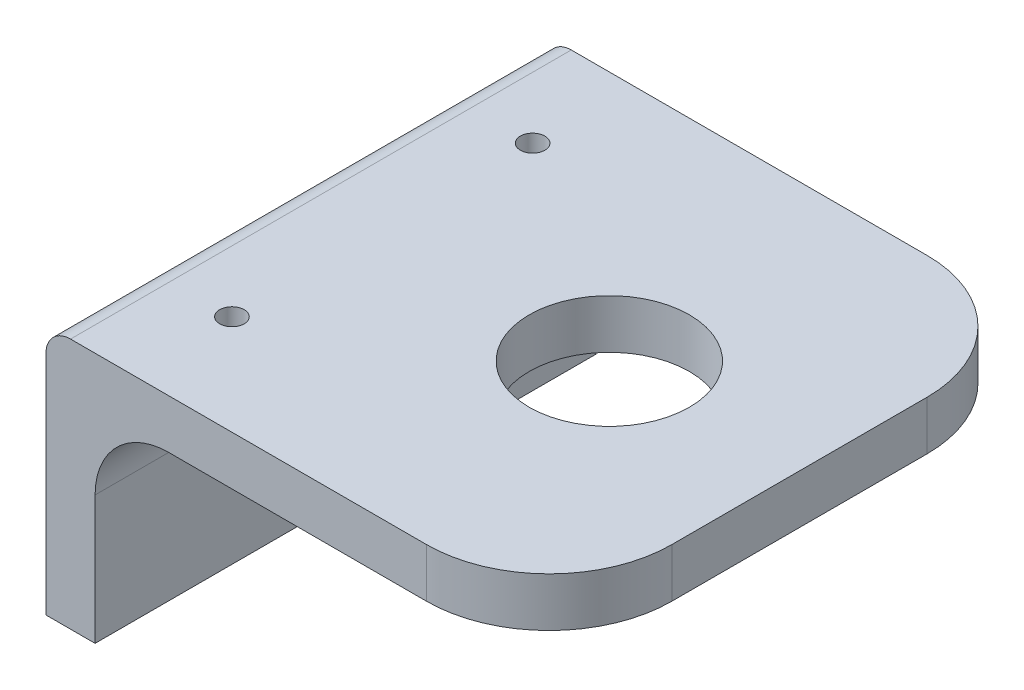
ISO-10303-21;
HEADER;
FILE_DESCRIPTION(('STEP AP214'),'2;1');
FILE_NAME('part.step','',(''),(''),'','','');
FILE_SCHEMA(('AUTOMOTIVE_DESIGN { 1 0 10303 214 1 1 1 1 }'));
ENDSEC;
DATA;
#1=APPLICATION_CONTEXT('core data for automotive mechanical design processes');
#2=APPLICATION_PROTOCOL_DEFINITION('international standard','automotive_design',2000,#1);
#3=PRODUCT_CONTEXT('',#1,'mechanical');
#4=PRODUCT('Part','Part','',(#3));
#5=PRODUCT_RELATED_PRODUCT_CATEGORY('part','',(#4));
#6=PRODUCT_DEFINITION_FORMATION('','',#4);
#7=PRODUCT_DEFINITION_CONTEXT('part definition',#1,'design');
#8=PRODUCT_DEFINITION('design','',#6,#7);
#9=PRODUCT_DEFINITION_SHAPE('','',#8);
#10=(LENGTH_UNIT() NAMED_UNIT(*) SI_UNIT(.MILLI.,.METRE.));
#11=(NAMED_UNIT(*) PLANE_ANGLE_UNIT() SI_UNIT($,.RADIAN.));
#12=(NAMED_UNIT(*) SI_UNIT($,.STERADIAN.) SOLID_ANGLE_UNIT());
#13=UNCERTAINTY_MEASURE_WITH_UNIT(LENGTH_MEASURE(1.E-05),#10,'distance_accuracy_value','');
#14=(GEOMETRIC_REPRESENTATION_CONTEXT(3) GLOBAL_UNCERTAINTY_ASSIGNED_CONTEXT((#13)) GLOBAL_UNIT_ASSIGNED_CONTEXT((#10,
#11,#12)) REPRESENTATION_CONTEXT('',''));
#15=CARTESIAN_POINT('',(0.,0.,0.));
#16=DIRECTION('',(0.,0.,1.));
#17=DIRECTION('',(1.,0.,0.));
#18=AXIS2_PLACEMENT_3D('',#15,#16,#17);
#19=CARTESIAN_POINT('',(0.,40.95,0.));
#20=DIRECTION('',(0.,1.,0.));
#21=DIRECTION('',(0.,0.,1.));
#22=AXIS2_PLACEMENT_3D('',#19,#20,#21);
#23=PLANE('',#22);
#24=DIRECTION('',(-1.,0.,0.));
#25=VECTOR('',#24,1.);
#26=CARTESIAN_POINT('',(41.,40.95,-40.8));
#27=LINE('',#26,#25);
#28=CARTESIAN_POINT('',(-33.,40.95,-40.8));
#29=VERTEX_POINT('',#28);
#30=CARTESIAN_POINT('',(-41.,40.95,-40.8));
#31=VERTEX_POINT('',#30);
#32=EDGE_CURVE('E197',#29,#31,#27,.T.);
#33=ORIENTED_EDGE('',*,*,#32,.F.);
#34=DIRECTION('',(0.,0.,-1.));
#35=VECTOR('',#34,1.);
#36=CARTESIAN_POINT('',(-33.,40.95,40.8));
#37=LINE('',#36,#35);
#38=CARTESIAN_POINT('',(-33.,40.95,40.8));
#39=VERTEX_POINT('',#38);
#40=EDGE_CURVE('E195',#39,#29,#37,.T.);
#41=ORIENTED_EDGE('',*,*,#40,.F.);
#42=DIRECTION('',(1.,0.,0.));
#43=VECTOR('',#42,1.);
#44=CARTESIAN_POINT('',(41.,40.95,40.8));
#45=LINE('',#44,#43);
#46=CARTESIAN_POINT('',(-41.,40.95,40.8));
#47=VERTEX_POINT('',#46);
#48=EDGE_CURVE('E46',#47,#39,#45,.T.);
#49=ORIENTED_EDGE('',*,*,#48,.F.);
#50=DIRECTION('',(0.,0.,1.));
#51=VECTOR('',#50,1.);
#52=CARTESIAN_POINT('',(-41.,40.95,40.8));
#53=LINE('',#52,#51);
#54=EDGE_CURVE('E11',#31,#47,#53,.T.);
#55=ORIENTED_EDGE('',*,*,#54,.F.);
#56=EDGE_LOOP('',(#33,#41,#49,#55));
#57=FACE_BOUND('',#56,.T.);
#58=ADVANCED_FACE('F39',(#57),#23,.F.);
#59=CARTESIAN_POINT('',(0.,73.9,0.));
#60=DIRECTION('',(0.,1.,0.));
#61=DIRECTION('',(0.,0.,1.));
#62=AXIS2_PLACEMENT_3D('',#59,#60,#61);
#63=PLANE('',#62);
#64=CARTESIAN_POINT('',(-27.,73.9,24.5));
#65=DIRECTION('',(0.,1.,0.));
#66=DIRECTION('',(0.,0.,1.));
#67=AXIS2_PLACEMENT_3D('',#64,#65,#66);
#68=CIRCLE('',#67,2.);
#69=CARTESIAN_POINT('',(-27.,73.9,26.5));
#70=VERTEX_POINT('',#69);
#71=EDGE_CURVE('E235',#70,#70,#68,.T.);
#72=ORIENTED_EDGE('',*,*,#71,.T.);
#73=EDGE_LOOP('',(#72));
#74=FACE_BOUND('',#73,.T.);
#75=ADVANCED_FACE('F305',(#74),#63,.T.);
#76=CARTESIAN_POINT('',(0.,73.9,0.));
#77=DIRECTION('',(0.,1.,0.));
#78=DIRECTION('',(0.,0.,1.));
#79=AXIS2_PLACEMENT_3D('',#76,#77,#78);
#80=PLANE('',#79);
#81=CARTESIAN_POINT('',(-27.,73.9,-24.5));
#82=DIRECTION('',(0.,1.,0.));
#83=DIRECTION('',(0.,0.,1.));
#84=AXIS2_PLACEMENT_3D('',#81,#82,#83);
#85=CIRCLE('',#84,2.);
#86=CARTESIAN_POINT('',(-27.,73.9,-22.5));
#87=VERTEX_POINT('',#86);
#88=EDGE_CURVE('E230',#87,#87,#85,.T.);
#89=ORIENTED_EDGE('',*,*,#88,.T.);
#90=EDGE_LOOP('',(#89));
#91=FACE_BOUND('',#90,.T.);
#92=ADVANCED_FACE('F309',(#91),#80,.T.);
#93=CARTESIAN_POINT('',(41.,81.9,40.8));
#94=DIRECTION('',(-1.,0.,0.));
#95=DIRECTION('',(0.,0.,1.));
#96=AXIS2_PLACEMENT_3D('',#93,#94,#95);
#97=PLANE('',#96);
#98=DIRECTION('',(0.,0.,-1.));
#99=VECTOR('',#98,1.);
#100=CARTESIAN_POINT('',(41.,81.9,40.8));
#101=LINE('',#100,#99);
#102=CARTESIAN_POINT('',(41.,81.9,20.8));
#103=VERTEX_POINT('',#102);
#104=CARTESIAN_POINT('',(41.,81.9,-20.8));
#105=VERTEX_POINT('',#104);
#106=EDGE_CURVE('E223',#103,#105,#101,.T.);
#107=ORIENTED_EDGE('',*,*,#106,.F.);
#108=DIRECTION('',(0.,-1.,0.));
#109=VECTOR('',#108,1.);
#110=CARTESIAN_POINT('',(41.,81.9,20.8));
#111=LINE('',#110,#109);
#112=CARTESIAN_POINT('',(41.,73.9,20.8));
#113=VERTEX_POINT('',#112);
#114=EDGE_CURVE('E172',#103,#113,#111,.T.);
#115=ORIENTED_EDGE('',*,*,#114,.T.);
#116=DIRECTION('',(0.,0.,-1.));
#117=VECTOR('',#116,1.);
#118=CARTESIAN_POINT('',(41.,73.9,40.8));
#119=LINE('',#118,#117);
#120=CARTESIAN_POINT('',(41.,73.9,-20.8));
#121=VERTEX_POINT('',#120);
#122=EDGE_CURVE('E214',#113,#121,#119,.T.);
#123=ORIENTED_EDGE('',*,*,#122,.T.);
#124=DIRECTION('',(0.,-1.,0.));
#125=VECTOR('',#124,1.);
#126=CARTESIAN_POINT('',(41.,81.9,-20.8));
#127=LINE('',#126,#125);
#128=EDGE_CURVE('E170',#121,#105,#127,.F.);
#129=ORIENTED_EDGE('',*,*,#128,.T.);
#130=EDGE_LOOP('',(#107,#115,#123,#129));
#131=FACE_BOUND('',#130,.T.);
#132=ADVANCED_FACE('F280',(#131),#97,.F.);
#133=CARTESIAN_POINT('',(10.,81.901,0.));
#134=DIRECTION('',(0.,-1.,0.));
#135=DIRECTION('',(0.,0.,-1.));
#136=AXIS2_PLACEMENT_3D('',#133,#134,#135);
#137=CYLINDRICAL_SURFACE('',#136,13.05);
#138=CARTESIAN_POINT('',(10.,81.9,0.));
#139=DIRECTION('',(0.,1.,0.));
#140=DIRECTION('',(0.,0.,1.));
#141=AXIS2_PLACEMENT_3D('',#138,#139,#140);
#142=CIRCLE('',#141,13.05);
#143=CARTESIAN_POINT('',(10.,81.9,13.05));
#144=VERTEX_POINT('',#143);
#145=EDGE_CURVE('E227',#144,#144,#142,.F.);
#146=ORIENTED_EDGE('',*,*,#145,.F.);
#147=EDGE_LOOP('',(#146));
#148=FACE_BOUND('',#147,.T.);
#149=CARTESIAN_POINT('',(10.,73.9,0.));
#150=DIRECTION('',(0.,-1.,0.));
#151=DIRECTION('',(0.,0.,-1.));
#152=AXIS2_PLACEMENT_3D('',#149,#150,#151);
#153=CIRCLE('',#152,13.05);
#154=CARTESIAN_POINT('',(10.,73.9,-13.05));
#155=VERTEX_POINT('',#154);
#156=EDGE_CURVE('E220',#155,#155,#153,.T.);
#157=ORIENTED_EDGE('',*,*,#156,.T.);
#158=EDGE_LOOP('',(#157));
#159=FACE_BOUND('',#158,.T.);
#160=ADVANCED_FACE('F332',(#148,#159),#137,.F.);
#161=CARTESIAN_POINT('',(-27.,73.9,24.5));
#162=DIRECTION('',(0.,1.,0.));
#163=DIRECTION('',(0.,0.,1.));
#164=AXIS2_PLACEMENT_3D('',#161,#162,#163);
#165=CYLINDRICAL_SURFACE('',#164,2.);
#166=ORIENTED_EDGE('',*,*,#71,.F.);
#167=EDGE_LOOP('',(#166));
#168=FACE_BOUND('',#167,.T.);
#169=CARTESIAN_POINT('',(-27.,81.9,24.5));
#170=DIRECTION('',(0.,1.,0.));
#171=DIRECTION('',(0.,0.,1.));
#172=AXIS2_PLACEMENT_3D('',#169,#170,#171);
#173=CIRCLE('',#172,2.);
#174=CARTESIAN_POINT('',(-27.,81.9,26.5));
#175=VERTEX_POINT('',#174);
#176=EDGE_CURVE('E141',#175,#175,#173,.T.);
#177=ORIENTED_EDGE('',*,*,#176,.T.);
#178=EDGE_LOOP('',(#177));
#179=FACE_BOUND('',#178,.T.);
#180=ADVANCED_FACE('F335',(#168,#179),#165,.F.);
#181=CARTESIAN_POINT('',(-27.,73.9,-24.5));
#182=DIRECTION('',(0.,1.,0.));
#183=DIRECTION('',(0.,0.,1.));
#184=AXIS2_PLACEMENT_3D('',#181,#182,#183);
#185=CYLINDRICAL_SURFACE('',#184,2.);
#186=ORIENTED_EDGE('',*,*,#88,.F.);
#187=EDGE_LOOP('',(#186));
#188=FACE_BOUND('',#187,.T.);
#189=CARTESIAN_POINT('',(-27.,81.9,-24.5));
#190=DIRECTION('',(0.,1.,0.));
#191=DIRECTION('',(0.,0.,1.));
#192=AXIS2_PLACEMENT_3D('',#189,#190,#191);
#193=CIRCLE('',#192,2.);
#194=CARTESIAN_POINT('',(-27.,81.9,-22.5));
#195=VERTEX_POINT('',#194);
#196=EDGE_CURVE('E238',#195,#195,#193,.T.);
#197=ORIENTED_EDGE('',*,*,#196,.T.);
#198=EDGE_LOOP('',(#197));
#199=FACE_BOUND('',#198,.T.);
#200=ADVANCED_FACE('F338',(#188,#199),#185,.F.);
#201=CARTESIAN_POINT('',(-33.,60.95,-25.));
#202=DIRECTION('',(-1.,0.,0.));
#203=DIRECTION('',(0.,0.,1.));
#204=AXIS2_PLACEMENT_3D('',#201,#202,#203);
#205=PLANE('',#204);
#206=CARTESIAN_POINT('',(-33.,60.95,-25.));
#207=DIRECTION('',(-1.,0.,0.));
#208=DIRECTION('',(0.,0.,1.));
#209=AXIS2_PLACEMENT_3D('',#206,#207,#208);
#210=CIRCLE('',#209,2.);
#211=CARTESIAN_POINT('',(-33.,61.9,-23.2400284093202));
#212=VERTEX_POINT('',#211);
#213=CARTESIAN_POINT('',(-33.,61.9,-26.7599715906798));
#214=VERTEX_POINT('',#213);
#215=EDGE_CURVE('E127',#212,#214,#210,.T.);
#216=ORIENTED_EDGE('',*,*,#215,.T.);
#217=DIRECTION('',(0.,0.,-1.));
#218=VECTOR('',#217,1.);
#219=CARTESIAN_POINT('',(-33.,61.9,40.8));
#220=LINE('',#219,#218);
#221=EDGE_CURVE('E124',#214,#212,#220,.F.);
#222=ORIENTED_EDGE('',*,*,#221,.T.);
#223=EDGE_LOOP('',(#216,#222));
#224=FACE_BOUND('',#223,.T.);
#225=ADVANCED_FACE('F126',(#224),#205,.T.);
#226=CARTESIAN_POINT('',(-33.,60.95,25.));
#227=DIRECTION('',(1.,0.,0.));
#228=DIRECTION('',(0.,0.,-1.));
#229=AXIS2_PLACEMENT_3D('',#226,#227,#228);
#230=PLANE('',#229);
#231=CARTESIAN_POINT('',(-33.,60.95,25.));
#232=DIRECTION('',(-1.,0.,0.));
#233=DIRECTION('',(0.,0.,-1.));
#234=AXIS2_PLACEMENT_3D('',#231,#232,#233);
#235=CIRCLE('',#234,2.);
#236=CARTESIAN_POINT('',(-33.,61.9,26.7599715906798));
#237=VERTEX_POINT('',#236);
#238=CARTESIAN_POINT('',(-33.,61.9,23.2400284093202));
#239=VERTEX_POINT('',#238);
#240=EDGE_CURVE('E246',#237,#239,#235,.T.);
#241=ORIENTED_EDGE('',*,*,#240,.T.);
#242=EDGE_CURVE('E154',#239,#237,#220,.F.);
#243=ORIENTED_EDGE('',*,*,#242,.T.);
#244=EDGE_LOOP('',(#241,#243));
#245=FACE_BOUND('',#244,.T.);
#246=ADVANCED_FACE('F299',(#245),#230,.F.);
#247=CARTESIAN_POINT('',(21.,81.9,20.8));
#248=DIRECTION('',(0.,-1.,0.));
#249=DIRECTION('',(0.,0.,-1.));
#250=AXIS2_PLACEMENT_3D('',#247,#248,#249);
#251=CYLINDRICAL_SURFACE('',#250,20.);
#252=CARTESIAN_POINT('',(21.,81.9,20.8));
#253=DIRECTION('',(0.,1.,0.));
#254=DIRECTION('',(0.,0.,1.));
#255=AXIS2_PLACEMENT_3D('',#252,#253,#254);
#256=CIRCLE('',#255,20.);
#257=CARTESIAN_POINT('',(21.,81.9,40.8));
#258=VERTEX_POINT('',#257);
#259=EDGE_CURVE('E181',#258,#103,#256,.T.);
#260=ORIENTED_EDGE('',*,*,#259,.F.);
#261=DIRECTION('',(0.,-1.,0.));
#262=VECTOR('',#261,1.);
#263=CARTESIAN_POINT('',(21.,8.,40.8));
#264=LINE('',#263,#262);
#265=CARTESIAN_POINT('',(21.,73.9,40.8));
#266=VERTEX_POINT('',#265);
#267=EDGE_CURVE('E167',#266,#258,#264,.F.);
#268=ORIENTED_EDGE('',*,*,#267,.F.);
#269=CARTESIAN_POINT('',(21.,73.9,20.8));
#270=DIRECTION('',(0.,1.,0.));
#271=DIRECTION('',(0.,0.,1.));
#272=AXIS2_PLACEMENT_3D('',#269,#270,#271);
#273=CIRCLE('',#272,20.);
#274=EDGE_CURVE('E177',#113,#266,#273,.F.);
#275=ORIENTED_EDGE('',*,*,#274,.F.);
#276=ORIENTED_EDGE('',*,*,#114,.F.);
#277=EDGE_LOOP('',(#260,#268,#275,#276));
#278=FACE_BOUND('',#277,.T.);
#279=ADVANCED_FACE('F276',(#278),#251,.T.);
#280=CARTESIAN_POINT('',(0.,73.9,0.));
#281=DIRECTION('',(0.,1.,0.));
#282=DIRECTION('',(0.,0.,1.));
#283=AXIS2_PLACEMENT_3D('',#280,#281,#282);
#284=PLANE('',#283);
#285=ORIENTED_EDGE('',*,*,#156,.F.);
#286=EDGE_LOOP('',(#285));
#287=FACE_BOUND('',#286,.T.);
#288=ORIENTED_EDGE('',*,*,#122,.F.);
#289=ORIENTED_EDGE('',*,*,#274,.T.);
#290=DIRECTION('',(1.,0.,0.));
#291=VECTOR('',#290,1.);
#292=CARTESIAN_POINT('',(41.,73.9,40.8));
#293=LINE('',#292,#291);
#294=CARTESIAN_POINT('',(-21.,73.9,40.8));
#295=VERTEX_POINT('',#294);
#296=EDGE_CURVE('E217',#295,#266,#293,.T.);
#297=ORIENTED_EDGE('',*,*,#296,.F.);
#298=DIRECTION('',(0.,0.,-1.));
#299=VECTOR('',#298,1.);
#300=CARTESIAN_POINT('',(-21.,73.9,-40.8));
#301=LINE('',#300,#299);
#302=CARTESIAN_POINT('',(-21.,73.9,-40.8));
#303=VERTEX_POINT('',#302);
#304=EDGE_CURVE('E158',#295,#303,#301,.T.);
#305=ORIENTED_EDGE('',*,*,#304,.T.);
#306=DIRECTION('',(-1.,0.,0.));
#307=VECTOR('',#306,1.);
#308=CARTESIAN_POINT('',(41.,73.9,-40.8));
#309=LINE('',#308,#307);
#310=CARTESIAN_POINT('',(21.,73.9,-40.8));
#311=VERTEX_POINT('',#310);
#312=EDGE_CURVE('E211',#311,#303,#309,.T.);
#313=ORIENTED_EDGE('',*,*,#312,.F.);
#314=CARTESIAN_POINT('',(21.,73.9,-20.8));
#315=DIRECTION('',(0.,1.,0.));
#316=DIRECTION('',(0.,0.,1.));
#317=AXIS2_PLACEMENT_3D('',#314,#315,#316);
#318=CIRCLE('',#317,20.);
#319=EDGE_CURVE('E175',#311,#121,#318,.F.);
#320=ORIENTED_EDGE('',*,*,#319,.T.);
#321=EDGE_LOOP('',(#288,#289,#297,#305,#313,#320));
#322=FACE_BOUND('',#321,.T.);
#323=ADVANCED_FACE('F289',(#287,#322),#284,.F.);
#324=CARTESIAN_POINT('',(21.,8.,-20.8));
#325=DIRECTION('',(0.,-1.,0.));
#326=DIRECTION('',(0.,0.,-1.));
#327=AXIS2_PLACEMENT_3D('',#324,#325,#326);
#328=CYLINDRICAL_SURFACE('',#327,20.);
#329=CARTESIAN_POINT('',(21.,81.9,-20.8));
#330=DIRECTION('',(0.,1.,0.));
#331=DIRECTION('',(0.,0.,1.));
#332=AXIS2_PLACEMENT_3D('',#329,#330,#331);
#333=CIRCLE('',#332,20.);
#334=CARTESIAN_POINT('',(21.,81.9,-40.8));
#335=VERTEX_POINT('',#334);
#336=EDGE_CURVE('E179',#105,#335,#333,.T.);
#337=ORIENTED_EDGE('',*,*,#336,.F.);
#338=ORIENTED_EDGE('',*,*,#128,.F.);
#339=ORIENTED_EDGE('',*,*,#319,.F.);
#340=DIRECTION('',(0.,-1.,0.));
#341=VECTOR('',#340,1.);
#342=CARTESIAN_POINT('',(21.,8.,-40.8));
#343=LINE('',#342,#341);
#344=EDGE_CURVE('E183',#335,#311,#343,.T.);
#345=ORIENTED_EDGE('',*,*,#344,.F.);
#346=EDGE_LOOP('',(#337,#338,#339,#345));
#347=FACE_BOUND('',#346,.T.);
#348=ADVANCED_FACE('F284',(#347),#328,.T.);
#349=CARTESIAN_POINT('',(0.,81.9,0.));
#350=DIRECTION('',(0.,1.,0.));
#351=DIRECTION('',(0.,0.,1.));
#352=AXIS2_PLACEMENT_3D('',#349,#350,#351);
#353=PLANE('',#352);
#354=ORIENTED_EDGE('',*,*,#196,.F.);
#355=EDGE_LOOP('',(#354));
#356=FACE_BOUND('',#355,.T.);
#357=ORIENTED_EDGE('',*,*,#176,.F.);
#358=EDGE_LOOP('',(#357));
#359=FACE_BOUND('',#358,.T.);
#360=ORIENTED_EDGE('',*,*,#145,.T.);
#361=EDGE_LOOP('',(#360));
#362=FACE_BOUND('',#361,.T.);
#363=DIRECTION('',(-1.,0.,0.));
#364=VECTOR('',#363,1.);
#365=CARTESIAN_POINT('',(41.,81.9,-40.8));
#366=LINE('',#365,#364);
#367=CARTESIAN_POINT('',(-37.,81.9,-40.8));
#368=VERTEX_POINT('',#367);
#369=EDGE_CURVE('E208',#335,#368,#366,.T.);
#370=ORIENTED_EDGE('',*,*,#369,.T.);
#371=DIRECTION('',(0.,0.,1.));
#372=VECTOR('',#371,1.);
#373=CARTESIAN_POINT('',(-37.,81.9,40.8));
#374=LINE('',#373,#372);
#375=CARTESIAN_POINT('',(-37.,81.9,40.8));
#376=VERTEX_POINT('',#375);
#377=EDGE_CURVE('E192',#368,#376,#374,.T.);
#378=ORIENTED_EDGE('',*,*,#377,.T.);
#379=DIRECTION('',(1.,0.,0.));
#380=VECTOR('',#379,1.);
#381=CARTESIAN_POINT('',(41.,81.9,40.8));
#382=LINE('',#381,#380);
#383=EDGE_CURVE('E213',#376,#258,#382,.T.);
#384=ORIENTED_EDGE('',*,*,#383,.T.);
#385=ORIENTED_EDGE('',*,*,#259,.T.);
#386=ORIENTED_EDGE('',*,*,#106,.T.);
#387=ORIENTED_EDGE('',*,*,#336,.T.);
#388=EDGE_LOOP('',(#370,#378,#384,#385,#386,#387));
#389=FACE_BOUND('',#388,.T.);
#390=ADVANCED_FACE('F270',(#356,#359,#362,#389),#353,.T.);
#391=CARTESIAN_POINT('',(-37.,77.9,0.));
#392=DIRECTION('',(0.,0.,-1.));
#393=DIRECTION('',(-1.,0.,0.));
#394=AXIS2_PLACEMENT_3D('',#391,#392,#393);
#395=CYLINDRICAL_SURFACE('',#394,4.);
#396=CARTESIAN_POINT('',(-37.,77.9,-40.8));
#397=DIRECTION('',(0.,0.,1.));
#398=DIRECTION('',(1.,0.,0.));
#399=AXIS2_PLACEMENT_3D('',#396,#397,#398);
#400=CIRCLE('',#399,4.);
#401=CARTESIAN_POINT('',(-41.,77.9,-40.8));
#402=VERTEX_POINT('',#401);
#403=EDGE_CURVE('E190',#402,#368,#400,.F.);
#404=ORIENTED_EDGE('',*,*,#403,.F.);
#405=DIRECTION('',(0.,0.,1.));
#406=VECTOR('',#405,1.);
#407=CARTESIAN_POINT('',(-41.,77.9,-40.8));
#408=LINE('',#407,#406);
#409=CARTESIAN_POINT('',(-41.,77.9,40.8));
#410=VERTEX_POINT('',#409);
#411=EDGE_CURVE('E186',#410,#402,#408,.F.);
#412=ORIENTED_EDGE('',*,*,#411,.F.);
#413=CARTESIAN_POINT('',(-37.,77.9,40.8));
#414=DIRECTION('',(0.,0.,-1.));
#415=DIRECTION('',(-1.,0.,0.));
#416=AXIS2_PLACEMENT_3D('',#413,#414,#415);
#417=CIRCLE('',#416,4.);
#418=EDGE_CURVE('E188',#376,#410,#417,.F.);
#419=ORIENTED_EDGE('',*,*,#418,.F.);
#420=ORIENTED_EDGE('',*,*,#377,.F.);
#421=EDGE_LOOP('',(#404,#412,#419,#420));
#422=FACE_BOUND('',#421,.T.);
#423=ADVANCED_FACE('F257',(#422),#395,.T.);
#424=CARTESIAN_POINT('',(-41.,8.,40.8));
#425=DIRECTION('',(1.,0.,0.));
#426=DIRECTION('',(0.,0.,-1.));
#427=AXIS2_PLACEMENT_3D('',#424,#425,#426);
#428=PLANE('',#427);
#429=CARTESIAN_POINT('',(-41.,60.95,25.));
#430=DIRECTION('',(-1.,0.,0.));
#431=DIRECTION('',(0.,0.,-1.));
#432=AXIS2_PLACEMENT_3D('',#429,#430,#431);
#433=CIRCLE('',#432,2.);
#434=CARTESIAN_POINT('',(-41.,60.95,23.));
#435=VERTEX_POINT('',#434);
#436=EDGE_CURVE('E244',#435,#435,#433,.T.);
#437=ORIENTED_EDGE('',*,*,#436,.F.);
#438=EDGE_LOOP('',(#437));
#439=FACE_BOUND('',#438,.T.);
#440=CARTESIAN_POINT('',(-41.,60.95,-25.));
#441=DIRECTION('',(-1.,0.,0.));
#442=DIRECTION('',(0.,0.,1.));
#443=AXIS2_PLACEMENT_3D('',#440,#441,#442);
#444=CIRCLE('',#443,2.);
#445=CARTESIAN_POINT('',(-41.,60.95,-23.));
#446=VERTEX_POINT('',#445);
#447=EDGE_CURVE('E149',#446,#446,#444,.T.);
#448=ORIENTED_EDGE('',*,*,#447,.F.);
#449=EDGE_LOOP('',(#448));
#450=FACE_BOUND('',#449,.T.);
#451=DIRECTION('',(0.,-1.,0.));
#452=VECTOR('',#451,1.);
#453=CARTESIAN_POINT('',(-41.,8.,-40.8));
#454=LINE('',#453,#452);
#455=EDGE_CURVE('E205',#402,#31,#454,.T.);
#456=ORIENTED_EDGE('',*,*,#455,.T.);
#457=ORIENTED_EDGE('',*,*,#54,.T.);
#458=DIRECTION('',(0.,-1.,0.));
#459=VECTOR('',#458,1.);
#460=CARTESIAN_POINT('',(-41.,8.,40.8));
#461=LINE('',#460,#459);
#462=EDGE_CURVE('E159',#410,#47,#461,.T.);
#463=ORIENTED_EDGE('',*,*,#462,.F.);
#464=ORIENTED_EDGE('',*,*,#411,.T.);
#465=EDGE_LOOP('',(#456,#457,#463,#464));
#466=FACE_BOUND('',#465,.T.);
#467=ADVANCED_FACE('F254',(#439,#450,#466),#428,.F.);
#468=CARTESIAN_POINT('',(-33.,60.95,25.));
#469=DIRECTION('',(-1.,0.,0.));
#470=DIRECTION('',(0.,0.,1.));
#471=AXIS2_PLACEMENT_3D('',#468,#469,#470);
#472=CYLINDRICAL_SURFACE('',#471,2.);
#473=ORIENTED_EDGE('',*,*,#240,.F.);
#474=EDGE_CURVE('E248',#239,#237,#235,.T.);
#475=ORIENTED_EDGE('',*,*,#474,.F.);
#476=EDGE_LOOP('',(#473,#475));
#477=FACE_BOUND('',#476,.T.);
#478=ORIENTED_EDGE('',*,*,#436,.T.);
#479=EDGE_LOOP('',(#478));
#480=FACE_BOUND('',#479,.T.);
#481=ADVANCED_FACE('F252',(#477,#480),#472,.F.);
#482=CARTESIAN_POINT('',(-33.,60.95,-25.));
#483=DIRECTION('',(-1.,0.,0.));
#484=DIRECTION('',(0.,0.,1.));
#485=AXIS2_PLACEMENT_3D('',#482,#483,#484);
#486=CYLINDRICAL_SURFACE('',#485,2.);
#487=ORIENTED_EDGE('',*,*,#215,.F.);
#488=EDGE_CURVE('E140',#214,#212,#210,.T.);
#489=ORIENTED_EDGE('',*,*,#488,.F.);
#490=EDGE_LOOP('',(#487,#489));
#491=FACE_BOUND('',#490,.T.);
#492=ORIENTED_EDGE('',*,*,#447,.T.);
#493=EDGE_LOOP('',(#492));
#494=FACE_BOUND('',#493,.T.);
#495=ADVANCED_FACE('F138',(#491,#494),#486,.F.);
#496=CARTESIAN_POINT('',(-21.,61.9,0.));
#497=DIRECTION('',(0.,0.,1.));
#498=DIRECTION('',(1.,0.,0.));
#499=AXIS2_PLACEMENT_3D('',#496,#497,#498);
#500=CYLINDRICAL_SURFACE('',#499,12.);
#501=CARTESIAN_POINT('',(-21.,61.9,40.8));
#502=DIRECTION('',(0.,0.,-1.));
#503=DIRECTION('',(-1.,0.,0.));
#504=AXIS2_PLACEMENT_3D('',#501,#502,#503);
#505=CIRCLE('',#504,12.);
#506=CARTESIAN_POINT('',(-33.,61.9,40.8));
#507=VERTEX_POINT('',#506);
#508=EDGE_CURVE('E165',#507,#295,#505,.T.);
#509=ORIENTED_EDGE('',*,*,#508,.F.);
#510=EDGE_CURVE('E155',#237,#507,#220,.F.);
#511=ORIENTED_EDGE('',*,*,#510,.F.);
#512=ORIENTED_EDGE('',*,*,#242,.F.);
#513=EDGE_CURVE('E134',#212,#239,#220,.F.);
#514=ORIENTED_EDGE('',*,*,#513,.F.);
#515=ORIENTED_EDGE('',*,*,#221,.F.);
#516=CARTESIAN_POINT('',(-33.,61.9,-40.8));
#517=VERTEX_POINT('',#516);
#518=EDGE_CURVE('E133',#517,#214,#220,.F.);
#519=ORIENTED_EDGE('',*,*,#518,.F.);
#520=CARTESIAN_POINT('',(-21.,61.9,-40.8));
#521=DIRECTION('',(0.,0.,1.));
#522=DIRECTION('',(1.,0.,0.));
#523=AXIS2_PLACEMENT_3D('',#520,#521,#522);
#524=CIRCLE('',#523,12.);
#525=EDGE_CURVE('E163',#303,#517,#524,.T.);
#526=ORIENTED_EDGE('',*,*,#525,.F.);
#527=ORIENTED_EDGE('',*,*,#304,.F.);
#528=EDGE_LOOP('',(#509,#511,#512,#514,#515,#519,#526,#527));
#529=FACE_BOUND('',#528,.T.);
#530=ADVANCED_FACE('F152',(#529),#500,.F.);
#531=CARTESIAN_POINT('',(41.,8.,-40.8));
#532=DIRECTION('',(0.,0.,1.));
#533=DIRECTION('',(1.,0.,0.));
#534=AXIS2_PLACEMENT_3D('',#531,#532,#533);
#535=PLANE('',#534);
#536=DIRECTION('',(0.,-1.,0.));
#537=VECTOR('',#536,1.);
#538=CARTESIAN_POINT('',(-33.,60.9,-40.8));
#539=LINE('',#538,#537);
#540=EDGE_CURVE('E206',#517,#29,#539,.T.);
#541=ORIENTED_EDGE('',*,*,#540,.T.);
#542=ORIENTED_EDGE('',*,*,#32,.T.);
#543=ORIENTED_EDGE('',*,*,#455,.F.);
#544=ORIENTED_EDGE('',*,*,#403,.T.);
#545=ORIENTED_EDGE('',*,*,#369,.F.);
#546=ORIENTED_EDGE('',*,*,#344,.T.);
#547=ORIENTED_EDGE('',*,*,#312,.T.);
#548=ORIENTED_EDGE('',*,*,#525,.T.);
#549=EDGE_LOOP('',(#541,#542,#543,#544,#545,#546,#547,#548));
#550=FACE_BOUND('',#549,.T.);
#551=ADVANCED_FACE('F264',(#550),#535,.F.);
#552=CARTESIAN_POINT('',(41.,8.,40.8));
#553=DIRECTION('',(0.,0.,-1.));
#554=DIRECTION('',(-1.,0.,0.));
#555=AXIS2_PLACEMENT_3D('',#552,#553,#554);
#556=PLANE('',#555);
#557=ORIENTED_EDGE('',*,*,#462,.T.);
#558=ORIENTED_EDGE('',*,*,#48,.T.);
#559=DIRECTION('',(0.,-1.,0.));
#560=VECTOR('',#559,1.);
#561=CARTESIAN_POINT('',(-33.,60.9,40.8));
#562=LINE('',#561,#560);
#563=EDGE_CURVE('E203',#507,#39,#562,.T.);
#564=ORIENTED_EDGE('',*,*,#563,.F.);
#565=ORIENTED_EDGE('',*,*,#508,.T.);
#566=ORIENTED_EDGE('',*,*,#296,.T.);
#567=ORIENTED_EDGE('',*,*,#267,.T.);
#568=ORIENTED_EDGE('',*,*,#383,.F.);
#569=ORIENTED_EDGE('',*,*,#418,.T.);
#570=EDGE_LOOP('',(#557,#558,#564,#565,#566,#567,#568,#569));
#571=FACE_BOUND('',#570,.T.);
#572=ADVANCED_FACE('F202',(#571),#556,.F.);
#573=CARTESIAN_POINT('',(-33.,60.9,40.8));
#574=DIRECTION('',(-1.,0.,0.));
#575=DIRECTION('',(0.,0.,1.));
#576=AXIS2_PLACEMENT_3D('',#573,#574,#575);
#577=PLANE('',#576);
#578=ORIENTED_EDGE('',*,*,#563,.T.);
#579=ORIENTED_EDGE('',*,*,#40,.T.);
#580=ORIENTED_EDGE('',*,*,#540,.F.);
#581=ORIENTED_EDGE('',*,*,#518,.T.);
#582=ORIENTED_EDGE('',*,*,#488,.T.);
#583=ORIENTED_EDGE('',*,*,#513,.T.);
#584=ORIENTED_EDGE('',*,*,#474,.T.);
#585=ORIENTED_EDGE('',*,*,#510,.T.);
#586=EDGE_LOOP('',(#578,#579,#580,#581,#582,#583,#584,#585));
#587=FACE_BOUND('',#586,.T.);
#588=ADVANCED_FACE('F146',(#587),#577,.F.);
#589=CLOSED_SHELL('',(#58,#75,#92,#132,#160,#180,#200,#225,#246,#279,#323,#348,#390,#423,#467,
#481,#495,#530,#551,#572,#588));
#590=MANIFOLD_SOLID_BREP('B2',#589);
#591=ADVANCED_BREP_SHAPE_REPRESENTATION('',(#18,#590),#14);
#592=SHAPE_DEFINITION_REPRESENTATION(#9,#591);
ENDSEC;
END-ISO-10303-21;
